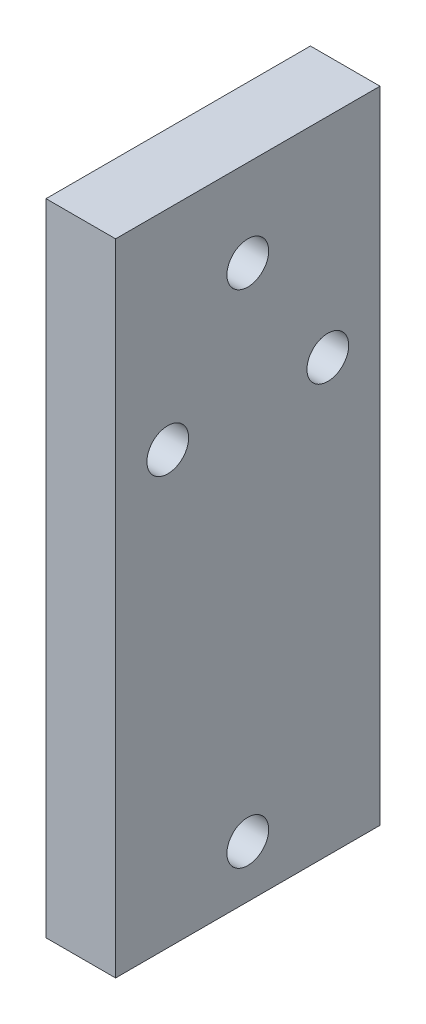
ISO-10303-21;
HEADER;
FILE_DESCRIPTION(('STEP AP214'),'2;1');
FILE_NAME('part.step','',(''),(''),'','','');
FILE_SCHEMA(('AUTOMOTIVE_DESIGN { 1 0 10303 214 1 1 1 1 }'));
ENDSEC;
DATA;
#1=APPLICATION_CONTEXT('core data for automotive mechanical design processes');
#2=APPLICATION_PROTOCOL_DEFINITION('international standard','automotive_design',2000,#1);
#3=PRODUCT_CONTEXT('',#1,'mechanical');
#4=PRODUCT('Part','Part','',(#3));
#5=PRODUCT_RELATED_PRODUCT_CATEGORY('part','',(#4));
#6=PRODUCT_DEFINITION_FORMATION('','',#4);
#7=PRODUCT_DEFINITION_CONTEXT('part definition',#1,'design');
#8=PRODUCT_DEFINITION('design','',#6,#7);
#9=PRODUCT_DEFINITION_SHAPE('','',#8);
#10=(LENGTH_UNIT() NAMED_UNIT(*) SI_UNIT(.MILLI.,.METRE.));
#11=(NAMED_UNIT(*) PLANE_ANGLE_UNIT() SI_UNIT($,.RADIAN.));
#12=(NAMED_UNIT(*) SI_UNIT($,.STERADIAN.) SOLID_ANGLE_UNIT());
#13=UNCERTAINTY_MEASURE_WITH_UNIT(LENGTH_MEASURE(1.E-05),#10,'distance_accuracy_value','');
#14=(GEOMETRIC_REPRESENTATION_CONTEXT(3) GLOBAL_UNCERTAINTY_ASSIGNED_CONTEXT((#13)) GLOBAL_UNIT_ASSIGNED_CONTEXT((#10,
#11,#12)) REPRESENTATION_CONTEXT('',''));
#15=CARTESIAN_POINT('',(0.,0.,0.));
#16=DIRECTION('',(0.,0.,1.));
#17=DIRECTION('',(1.,0.,0.));
#18=AXIS2_PLACEMENT_3D('',#15,#16,#17);
#19=CARTESIAN_POINT('',(10.,8.34375000000001,17.65625));
#20=DIRECTION('',(0.,0.,-1.));
#21=DIRECTION('',(0.,1.,0.));
#22=AXIS2_PLACEMENT_3D('',#19,#20,#21);
#23=PLANE('',#22);
#24=DIRECTION('',(0.,-1.,0.));
#25=VECTOR('',#24,1.);
#26=CARTESIAN_POINT('',(0.,8.34375000000001,17.65625));
#27=LINE('',#26,#25);
#28=CARTESIAN_POINT('',(0.,8.34375000000001,17.65625));
#29=VERTEX_POINT('',#28);
#30=CARTESIAN_POINT('',(0.,-83.65625,17.65625));
#31=VERTEX_POINT('',#30);
#32=EDGE_CURVE('E152',#29,#31,#27,.T.);
#33=ORIENTED_EDGE('',*,*,#32,.T.);
#34=DIRECTION('',(-1.,0.,0.));
#35=VECTOR('',#34,1.);
#36=CARTESIAN_POINT('',(10.,-83.65625,17.65625));
#37=LINE('',#36,#35);
#38=CARTESIAN_POINT('',(10.,-83.65625,17.65625));
#39=VERTEX_POINT('',#38);
#40=EDGE_CURVE('E11',#39,#31,#37,.T.);
#41=ORIENTED_EDGE('',*,*,#40,.F.);
#42=DIRECTION('',(0.,-1.,0.));
#43=VECTOR('',#42,1.);
#44=CARTESIAN_POINT('',(10.,8.34375000000001,17.65625));
#45=LINE('',#44,#43);
#46=CARTESIAN_POINT('',(10.,8.34375000000001,17.65625));
#47=VERTEX_POINT('',#46);
#48=EDGE_CURVE('E156',#47,#39,#45,.T.);
#49=ORIENTED_EDGE('',*,*,#48,.F.);
#50=DIRECTION('',(-1.,0.,0.));
#51=VECTOR('',#50,1.);
#52=CARTESIAN_POINT('',(10.,8.34375000000001,17.65625));
#53=LINE('',#52,#51);
#54=EDGE_CURVE('E162',#47,#29,#53,.T.);
#55=ORIENTED_EDGE('',*,*,#54,.T.);
#56=EDGE_LOOP('',(#33,#41,#49,#55));
#57=FACE_BOUND('',#56,.T.);
#58=ADVANCED_FACE('F40',(#57),#23,.F.);
#59=CARTESIAN_POINT('',(10.,-83.65625,17.65625));
#60=DIRECTION('',(0.,1.,0.));
#61=DIRECTION('',(0.,0.,1.));
#62=AXIS2_PLACEMENT_3D('',#59,#60,#61);
#63=PLANE('',#62);
#64=DIRECTION('',(0.,0.,-1.));
#65=VECTOR('',#64,1.);
#66=CARTESIAN_POINT('',(0.,-83.65625,17.65625));
#67=LINE('',#66,#65);
#68=CARTESIAN_POINT('',(0.,-83.65625,-20.34375));
#69=VERTEX_POINT('',#68);
#70=EDGE_CURVE('E165',#31,#69,#67,.T.);
#71=ORIENTED_EDGE('',*,*,#70,.T.);
#72=DIRECTION('',(-1.,0.,0.));
#73=VECTOR('',#72,1.);
#74=CARTESIAN_POINT('',(10.,-83.65625,-20.34375));
#75=LINE('',#74,#73);
#76=CARTESIAN_POINT('',(10.,-83.65625,-20.34375));
#77=VERTEX_POINT('',#76);
#78=EDGE_CURVE('E47',#77,#69,#75,.T.);
#79=ORIENTED_EDGE('',*,*,#78,.F.);
#80=DIRECTION('',(0.,0.,-1.));
#81=VECTOR('',#80,1.);
#82=CARTESIAN_POINT('',(10.,-83.65625,17.65625));
#83=LINE('',#82,#81);
#84=EDGE_CURVE('E91',#39,#77,#83,.T.);
#85=ORIENTED_EDGE('',*,*,#84,.F.);
#86=ORIENTED_EDGE('',*,*,#40,.T.);
#87=EDGE_LOOP('',(#71,#79,#85,#86));
#88=FACE_BOUND('',#87,.T.);
#89=ADVANCED_FACE('F195',(#88),#63,.F.);
#90=CARTESIAN_POINT('',(10.,8.34375000000001,-20.34375));
#91=DIRECTION('',(0.,0.,1.));
#92=DIRECTION('',(0.,-1.,0.));
#93=AXIS2_PLACEMENT_3D('',#90,#91,#92);
#94=PLANE('',#93);
#95=DIRECTION('',(0.,1.,0.));
#96=VECTOR('',#95,1.);
#97=CARTESIAN_POINT('',(0.,8.34375000000001,-20.34375));
#98=LINE('',#97,#96);
#99=CARTESIAN_POINT('',(0.,8.34375000000001,-20.34375));
#100=VERTEX_POINT('',#99);
#101=EDGE_CURVE('E167',#69,#100,#98,.T.);
#102=ORIENTED_EDGE('',*,*,#101,.T.);
#103=DIRECTION('',(-1.,0.,0.));
#104=VECTOR('',#103,1.);
#105=CARTESIAN_POINT('',(10.,8.34375000000001,-20.34375));
#106=LINE('',#105,#104);
#107=CARTESIAN_POINT('',(10.,8.34375000000001,-20.34375));
#108=VERTEX_POINT('',#107);
#109=EDGE_CURVE('E171',#108,#100,#106,.T.);
#110=ORIENTED_EDGE('',*,*,#109,.F.);
#111=DIRECTION('',(0.,1.,0.));
#112=VECTOR('',#111,1.);
#113=CARTESIAN_POINT('',(10.,8.34375000000001,-20.34375));
#114=LINE('',#113,#112);
#115=EDGE_CURVE('E159',#77,#108,#114,.T.);
#116=ORIENTED_EDGE('',*,*,#115,.F.);
#117=ORIENTED_EDGE('',*,*,#78,.T.);
#118=EDGE_LOOP('',(#102,#110,#116,#117));
#119=FACE_BOUND('',#118,.T.);
#120=ADVANCED_FACE('F176',(#119),#94,.F.);
#121=CARTESIAN_POINT('',(10.,8.34375000000001,17.65625));
#122=DIRECTION('',(0.,-1.,0.));
#123=DIRECTION('',(0.,0.,-1.));
#124=AXIS2_PLACEMENT_3D('',#121,#122,#123);
#125=PLANE('',#124);
#126=DIRECTION('',(0.,0.,1.));
#127=VECTOR('',#126,1.);
#128=CARTESIAN_POINT('',(0.,8.34375000000001,17.65625));
#129=LINE('',#128,#127);
#130=EDGE_CURVE('E84',#100,#29,#129,.T.);
#131=ORIENTED_EDGE('',*,*,#130,.T.);
#132=ORIENTED_EDGE('',*,*,#54,.F.);
#133=DIRECTION('',(0.,0.,1.));
#134=VECTOR('',#133,1.);
#135=CARTESIAN_POINT('',(10.,8.34375000000001,17.65625));
#136=LINE('',#135,#134);
#137=EDGE_CURVE('E63',#108,#47,#136,.T.);
#138=ORIENTED_EDGE('',*,*,#137,.F.);
#139=ORIENTED_EDGE('',*,*,#109,.T.);
#140=EDGE_LOOP('',(#131,#132,#138,#139));
#141=FACE_BOUND('',#140,.T.);
#142=ADVANCED_FACE('F184',(#141),#125,.F.);
#143=CARTESIAN_POINT('',(10.,0.,0.));
#144=DIRECTION('',(1.,0.,0.));
#145=DIRECTION('',(0.,0.,-1.));
#146=AXIS2_PLACEMENT_3D('',#143,#144,#145);
#147=PLANE('',#146);
#148=CARTESIAN_POINT('',(10.,-21.6562499999982,10.1562499999994));
#149=DIRECTION('',(-1.,0.,0.));
#150=DIRECTION('',(0.,0.,1.));
#151=AXIS2_PLACEMENT_3D('',#148,#149,#150);
#152=CIRCLE('',#151,3.00000000000841);
#153=CARTESIAN_POINT('',(10.,-21.6562499999982,13.1562500000078));
#154=VERTEX_POINT('',#153);
#155=EDGE_CURVE('E381',#154,#154,#152,.T.);
#156=ORIENTED_EDGE('',*,*,#155,.T.);
#157=EDGE_LOOP('',(#156));
#158=FACE_BOUND('',#157,.T.);
#159=CARTESIAN_POINT('',(10.,-21.6562499999981,-12.8437500000006));
#160=DIRECTION('',(-1.,0.,0.));
#161=DIRECTION('',(0.,0.,1.));
#162=AXIS2_PLACEMENT_3D('',#159,#160,#161);
#163=CIRCLE('',#162,3.00000000000841);
#164=CARTESIAN_POINT('',(10.,-21.6562499999981,-9.84374999999215));
#165=VERTEX_POINT('',#164);
#166=EDGE_CURVE('E390',#165,#165,#163,.T.);
#167=ORIENTED_EDGE('',*,*,#166,.T.);
#168=EDGE_LOOP('',(#167));
#169=FACE_BOUND('',#168,.T.);
#170=CARTESIAN_POINT('',(10.,-76.1562499999984,-1.34374999998675));
#171=DIRECTION('',(-1.,0.,0.));
#172=DIRECTION('',(0.,0.,1.));
#173=AXIS2_PLACEMENT_3D('',#170,#171,#172);
#174=CIRCLE('',#173,3.);
#175=CARTESIAN_POINT('',(10.,-76.1562499999984,1.65625000001325));
#176=VERTEX_POINT('',#175);
#177=EDGE_CURVE('E395',#176,#176,#174,.T.);
#178=ORIENTED_EDGE('',*,*,#177,.T.);
#179=EDGE_LOOP('',(#178));
#180=FACE_BOUND('',#179,.T.);
#181=CARTESIAN_POINT('',(10.,-4.15624999999999,-1.34375000000002));
#182=DIRECTION('',(-1.,0.,0.));
#183=DIRECTION('',(0.,0.,1.));
#184=AXIS2_PLACEMENT_3D('',#181,#182,#183);
#185=CIRCLE('',#184,3.);
#186=CARTESIAN_POINT('',(10.,-4.15624999999999,1.65624999999998));
#187=VERTEX_POINT('',#186);
#188=EDGE_CURVE('E146',#187,#187,#185,.T.);
#189=ORIENTED_EDGE('',*,*,#188,.T.);
#190=EDGE_LOOP('',(#189));
#191=FACE_BOUND('',#190,.T.);
#192=ORIENTED_EDGE('',*,*,#48,.T.);
#193=ORIENTED_EDGE('',*,*,#84,.T.);
#194=ORIENTED_EDGE('',*,*,#115,.T.);
#195=ORIENTED_EDGE('',*,*,#137,.T.);
#196=EDGE_LOOP('',(#192,#193,#194,#195));
#197=FACE_BOUND('',#196,.T.);
#198=ADVANCED_FACE('F186',(#158,#169,#180,#191,#197),#147,.T.);
#199=CARTESIAN_POINT('',(0.,0.,0.));
#200=DIRECTION('',(1.,0.,0.));
#201=DIRECTION('',(0.,0.,-1.));
#202=AXIS2_PLACEMENT_3D('',#199,#200,#201);
#203=PLANE('',#202);
#204=CARTESIAN_POINT('',(0.,-21.6562499999982,10.1562499999994));
#205=DIRECTION('',(-1.,0.,0.));
#206=DIRECTION('',(0.,0.,1.));
#207=AXIS2_PLACEMENT_3D('',#204,#205,#206);
#208=CIRCLE('',#207,3.00000000000841);
#209=CARTESIAN_POINT('',(0.,-21.6562499999982,13.1562500000078));
#210=VERTEX_POINT('',#209);
#211=EDGE_CURVE('E384',#210,#210,#208,.T.);
#212=ORIENTED_EDGE('',*,*,#211,.F.);
#213=EDGE_LOOP('',(#212));
#214=FACE_BOUND('',#213,.T.);
#215=CARTESIAN_POINT('',(0.,-21.6562499999981,-12.8437500000006));
#216=DIRECTION('',(-1.,0.,0.));
#217=DIRECTION('',(0.,0.,1.));
#218=AXIS2_PLACEMENT_3D('',#215,#216,#217);
#219=CIRCLE('',#218,3.00000000000841);
#220=CARTESIAN_POINT('',(0.,-21.6562499999981,-9.84374999999215));
#221=VERTEX_POINT('',#220);
#222=EDGE_CURVE('E385',#221,#221,#219,.T.);
#223=ORIENTED_EDGE('',*,*,#222,.F.);
#224=EDGE_LOOP('',(#223));
#225=FACE_BOUND('',#224,.T.);
#226=CARTESIAN_POINT('',(0.,-76.1562499999984,-1.34374999998675));
#227=DIRECTION('',(-1.,0.,0.));
#228=DIRECTION('',(0.,0.,1.));
#229=AXIS2_PLACEMENT_3D('',#226,#227,#228);
#230=CIRCLE('',#229,3.);
#231=CARTESIAN_POINT('',(0.,-76.1562499999984,1.65625000001325));
#232=VERTEX_POINT('',#231);
#233=EDGE_CURVE('E387',#232,#232,#230,.T.);
#234=ORIENTED_EDGE('',*,*,#233,.F.);
#235=EDGE_LOOP('',(#234));
#236=FACE_BOUND('',#235,.T.);
#237=DIRECTION('',(0.,0.,-1.));
#238=VECTOR('',#237,1.);
#239=CARTESIAN_POINT('',(0.,-0.656249999999986,2.15624999999998));
#240=LINE('',#239,#238);
#241=CARTESIAN_POINT('',(0.,-0.656249999999986,2.15624999999998));
#242=VERTEX_POINT('',#241);
#243=CARTESIAN_POINT('',(0.,-0.656249999999987,-4.84375000000002));
#244=VERTEX_POINT('',#243);
#245=EDGE_CURVE('E145',#242,#244,#240,.T.);
#246=ORIENTED_EDGE('',*,*,#245,.F.);
#247=DIRECTION('',(0.,1.,0.));
#248=VECTOR('',#247,1.);
#249=CARTESIAN_POINT('',(0.,-0.656249999999986,2.15624999999998));
#250=LINE('',#249,#248);
#251=CARTESIAN_POINT('',(0.,-7.65624999999999,2.15624999999998));
#252=VERTEX_POINT('',#251);
#253=EDGE_CURVE('E54',#252,#242,#250,.T.);
#254=ORIENTED_EDGE('',*,*,#253,.F.);
#255=DIRECTION('',(0.,0.,1.));
#256=VECTOR('',#255,1.);
#257=CARTESIAN_POINT('',(0.,-7.65624999999999,2.15624999999998));
#258=LINE('',#257,#256);
#259=CARTESIAN_POINT('',(0.,-7.65624999999999,-4.84375000000002));
#260=VERTEX_POINT('',#259);
#261=EDGE_CURVE('E133',#260,#252,#258,.T.);
#262=ORIENTED_EDGE('',*,*,#261,.F.);
#263=DIRECTION('',(0.,-1.,0.));
#264=VECTOR('',#263,1.);
#265=CARTESIAN_POINT('',(0.,-0.656249999999987,-4.84375000000002));
#266=LINE('',#265,#264);
#267=EDGE_CURVE('E136',#244,#260,#266,.T.);
#268=ORIENTED_EDGE('',*,*,#267,.F.);
#269=EDGE_LOOP('',(#246,#254,#262,#268));
#270=FACE_BOUND('',#269,.T.);
#271=ORIENTED_EDGE('',*,*,#32,.F.);
#272=ORIENTED_EDGE('',*,*,#130,.F.);
#273=ORIENTED_EDGE('',*,*,#101,.F.);
#274=ORIENTED_EDGE('',*,*,#70,.F.);
#275=EDGE_LOOP('',(#271,#272,#273,#274));
#276=FACE_BOUND('',#275,.T.);
#277=ADVANCED_FACE('F180',(#214,#225,#236,#270,#276),#203,.F.);
#278=CARTESIAN_POINT('',(3.,-0.656249999999986,2.15624999999998));
#279=DIRECTION('',(0.,0.,1.));
#280=DIRECTION('',(0.,-1.,0.));
#281=AXIS2_PLACEMENT_3D('',#278,#279,#280);
#282=PLANE('',#281);
#283=ORIENTED_EDGE('',*,*,#253,.T.);
#284=DIRECTION('',(-1.,0.,0.));
#285=VECTOR('',#284,1.);
#286=CARTESIAN_POINT('',(3.,-0.656249999999986,2.15624999999998));
#287=LINE('',#286,#285);
#288=CARTESIAN_POINT('',(3.,-0.656249999999986,2.15624999999998));
#289=VERTEX_POINT('',#288);
#290=EDGE_CURVE('E111',#289,#242,#287,.T.);
#291=ORIENTED_EDGE('',*,*,#290,.F.);
#292=DIRECTION('',(0.,1.,0.));
#293=VECTOR('',#292,1.);
#294=CARTESIAN_POINT('',(3.,-0.656249999999986,2.15624999999998));
#295=LINE('',#294,#293);
#296=CARTESIAN_POINT('',(3.,-7.65624999999999,2.15624999999998));
#297=VERTEX_POINT('',#296);
#298=EDGE_CURVE('E115',#297,#289,#295,.T.);
#299=ORIENTED_EDGE('',*,*,#298,.F.);
#300=DIRECTION('',(-1.,0.,0.));
#301=VECTOR('',#300,1.);
#302=CARTESIAN_POINT('',(3.,-7.65624999999999,2.15624999999998));
#303=LINE('',#302,#301);
#304=EDGE_CURVE('E150',#297,#252,#303,.T.);
#305=ORIENTED_EDGE('',*,*,#304,.T.);
#306=EDGE_LOOP('',(#283,#291,#299,#305));
#307=FACE_BOUND('',#306,.T.);
#308=ADVANCED_FACE('F113',(#307),#282,.F.);
#309=CARTESIAN_POINT('',(3.,-7.65624999999999,2.15624999999998));
#310=DIRECTION('',(0.,-1.,0.));
#311=DIRECTION('',(0.,0.,-1.));
#312=AXIS2_PLACEMENT_3D('',#309,#310,#311);
#313=PLANE('',#312);
#314=ORIENTED_EDGE('',*,*,#261,.T.);
#315=ORIENTED_EDGE('',*,*,#304,.F.);
#316=DIRECTION('',(0.,0.,1.));
#317=VECTOR('',#316,1.);
#318=CARTESIAN_POINT('',(3.,-7.65624999999999,2.15624999999998));
#319=LINE('',#318,#317);
#320=CARTESIAN_POINT('',(3.,-7.65624999999999,-4.84375000000002));
#321=VERTEX_POINT('',#320);
#322=EDGE_CURVE('E121',#321,#297,#319,.T.);
#323=ORIENTED_EDGE('',*,*,#322,.F.);
#324=DIRECTION('',(-1.,0.,0.));
#325=VECTOR('',#324,1.);
#326=CARTESIAN_POINT('',(3.,-7.65624999999999,-4.84375000000002));
#327=LINE('',#326,#325);
#328=EDGE_CURVE('E153',#321,#260,#327,.T.);
#329=ORIENTED_EDGE('',*,*,#328,.T.);
#330=EDGE_LOOP('',(#314,#315,#323,#329));
#331=FACE_BOUND('',#330,.T.);
#332=ADVANCED_FACE('F239',(#331),#313,.F.);
#333=CARTESIAN_POINT('',(3.,-0.656249999999987,-4.84375000000002));
#334=DIRECTION('',(0.,0.,-1.));
#335=DIRECTION('',(0.,1.,0.));
#336=AXIS2_PLACEMENT_3D('',#333,#334,#335);
#337=PLANE('',#336);
#338=ORIENTED_EDGE('',*,*,#267,.T.);
#339=ORIENTED_EDGE('',*,*,#328,.F.);
#340=DIRECTION('',(0.,-1.,0.));
#341=VECTOR('',#340,1.);
#342=CARTESIAN_POINT('',(3.,-0.656249999999987,-4.84375000000002));
#343=LINE('',#342,#341);
#344=CARTESIAN_POINT('',(3.,-0.656249999999987,-4.84375000000002));
#345=VERTEX_POINT('',#344);
#346=EDGE_CURVE('E129',#345,#321,#343,.T.);
#347=ORIENTED_EDGE('',*,*,#346,.F.);
#348=DIRECTION('',(-1.,0.,0.));
#349=VECTOR('',#348,1.);
#350=CARTESIAN_POINT('',(3.,-0.656249999999987,-4.84375000000002));
#351=LINE('',#350,#349);
#352=EDGE_CURVE('E120',#345,#244,#351,.T.);
#353=ORIENTED_EDGE('',*,*,#352,.T.);
#354=EDGE_LOOP('',(#338,#339,#347,#353));
#355=FACE_BOUND('',#354,.T.);
#356=ADVANCED_FACE('F247',(#355),#337,.F.);
#357=CARTESIAN_POINT('',(3.,-0.656249999999986,2.15624999999998));
#358=DIRECTION('',(0.,1.,0.));
#359=DIRECTION('',(0.,0.,1.));
#360=AXIS2_PLACEMENT_3D('',#357,#358,#359);
#361=PLANE('',#360);
#362=ORIENTED_EDGE('',*,*,#245,.T.);
#363=ORIENTED_EDGE('',*,*,#352,.F.);
#364=DIRECTION('',(0.,0.,-1.));
#365=VECTOR('',#364,1.);
#366=CARTESIAN_POINT('',(3.,-0.656249999999986,2.15624999999998));
#367=LINE('',#366,#365);
#368=EDGE_CURVE('E124',#289,#345,#367,.T.);
#369=ORIENTED_EDGE('',*,*,#368,.F.);
#370=ORIENTED_EDGE('',*,*,#290,.T.);
#371=EDGE_LOOP('',(#362,#363,#369,#370));
#372=FACE_BOUND('',#371,.T.);
#373=ADVANCED_FACE('F125',(#372),#361,.F.);
#374=CARTESIAN_POINT('',(3.,0.,0.));
#375=DIRECTION('',(1.,0.,0.));
#376=DIRECTION('',(0.,0.,-1.));
#377=AXIS2_PLACEMENT_3D('',#374,#375,#376);
#378=PLANE('',#377);
#379=CARTESIAN_POINT('',(3.,-4.15624999999999,-1.34375000000002));
#380=DIRECTION('',(-1.,0.,0.));
#381=DIRECTION('',(0.,0.,1.));
#382=AXIS2_PLACEMENT_3D('',#379,#380,#381);
#383=CIRCLE('',#382,3.);
#384=CARTESIAN_POINT('',(3.,-4.15624999999999,1.65624999999998));
#385=VERTEX_POINT('',#384);
#386=EDGE_CURVE('E139',#385,#385,#383,.T.);
#387=ORIENTED_EDGE('',*,*,#386,.F.);
#388=EDGE_LOOP('',(#387));
#389=FACE_BOUND('',#388,.T.);
#390=ORIENTED_EDGE('',*,*,#298,.T.);
#391=ORIENTED_EDGE('',*,*,#368,.T.);
#392=ORIENTED_EDGE('',*,*,#346,.T.);
#393=ORIENTED_EDGE('',*,*,#322,.T.);
#394=EDGE_LOOP('',(#390,#391,#392,#393));
#395=FACE_BOUND('',#394,.T.);
#396=ADVANCED_FACE('F131',(#389,#395),#378,.F.);
#397=CARTESIAN_POINT('',(10.,-4.15624999999999,-1.34375000000002));
#398=DIRECTION('',(-1.,0.,0.));
#399=DIRECTION('',(0.,0.,1.));
#400=AXIS2_PLACEMENT_3D('',#397,#398,#399);
#401=CYLINDRICAL_SURFACE('',#400,3.);
#402=ORIENTED_EDGE('',*,*,#188,.F.);
#403=EDGE_LOOP('',(#402));
#404=FACE_BOUND('',#403,.T.);
#405=ORIENTED_EDGE('',*,*,#386,.T.);
#406=EDGE_LOOP('',(#405));
#407=FACE_BOUND('',#406,.T.);
#408=ADVANCED_FACE('F274',(#404,#407),#401,.F.);
#409=CARTESIAN_POINT('',(10.,-76.1562499999984,-1.34374999998675));
#410=DIRECTION('',(-1.,0.,0.));
#411=DIRECTION('',(0.,0.,1.));
#412=AXIS2_PLACEMENT_3D('',#409,#410,#411);
#413=CYLINDRICAL_SURFACE('',#412,3.);
#414=ORIENTED_EDGE('',*,*,#177,.F.);
#415=EDGE_LOOP('',(#414));
#416=FACE_BOUND('',#415,.T.);
#417=ORIENTED_EDGE('',*,*,#233,.T.);
#418=EDGE_LOOP('',(#417));
#419=FACE_BOUND('',#418,.T.);
#420=ADVANCED_FACE('F284',(#416,#419),#413,.F.);
#421=CARTESIAN_POINT('',(10.,-21.6562499999981,-12.8437500000006));
#422=DIRECTION('',(-1.,0.,0.));
#423=DIRECTION('',(0.,0.,1.));
#424=AXIS2_PLACEMENT_3D('',#421,#422,#423);
#425=CYLINDRICAL_SURFACE('',#424,3.00000000000841);
#426=ORIENTED_EDGE('',*,*,#166,.F.);
#427=EDGE_LOOP('',(#426));
#428=FACE_BOUND('',#427,.T.);
#429=ORIENTED_EDGE('',*,*,#222,.T.);
#430=EDGE_LOOP('',(#429));
#431=FACE_BOUND('',#430,.T.);
#432=ADVANCED_FACE('F294',(#428,#431),#425,.F.);
#433=CARTESIAN_POINT('',(10.,-21.6562499999982,10.1562499999994));
#434=DIRECTION('',(-1.,0.,0.));
#435=DIRECTION('',(0.,0.,1.));
#436=AXIS2_PLACEMENT_3D('',#433,#434,#435);
#437=CYLINDRICAL_SURFACE('',#436,3.00000000000841);
#438=ORIENTED_EDGE('',*,*,#155,.F.);
#439=EDGE_LOOP('',(#438));
#440=FACE_BOUND('',#439,.T.);
#441=ORIENTED_EDGE('',*,*,#211,.T.);
#442=EDGE_LOOP('',(#441));
#443=FACE_BOUND('',#442,.T.);
#444=ADVANCED_FACE('F304',(#440,#443),#437,.F.);
#445=CLOSED_SHELL('',(#58,#89,#120,#142,#198,#277,#308,#332,#356,#373,#396,#408,#420,#432,#444));
#446=MANIFOLD_SOLID_BREP('B2',#445);
#447=ADVANCED_BREP_SHAPE_REPRESENTATION('',(#18,#446),#14);
#448=SHAPE_DEFINITION_REPRESENTATION(#9,#447);
ENDSEC;
END-ISO-10303-21;
